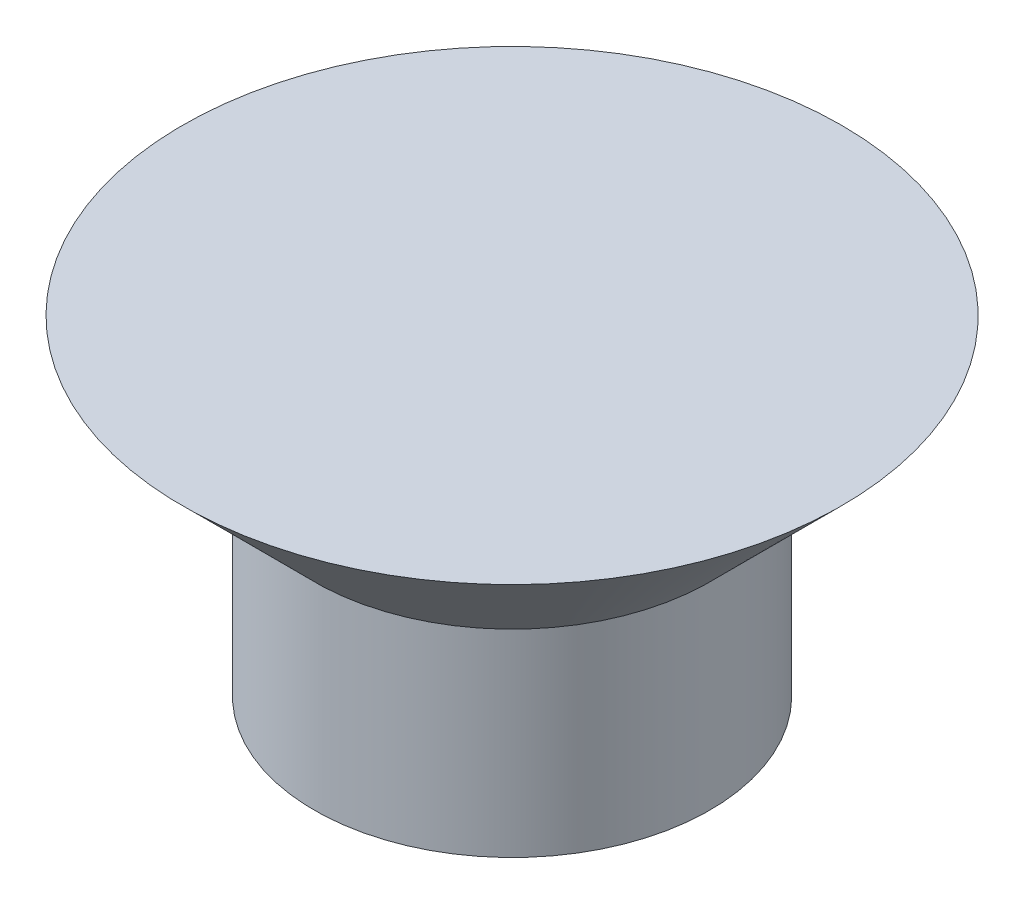
ISO-10303-21;
HEADER;
FILE_DESCRIPTION(('STEP AP214'),'2;1');
FILE_NAME('part.step','',(''),(''),'','','');
FILE_SCHEMA(('AUTOMOTIVE_DESIGN { 1 0 10303 214 1 1 1 1 }'));
ENDSEC;
DATA;
#1=APPLICATION_CONTEXT('core data for automotive mechanical design processes');
#2=APPLICATION_PROTOCOL_DEFINITION('international standard','automotive_design',2000,#1);
#3=PRODUCT_CONTEXT('',#1,'mechanical');
#4=PRODUCT('Part','Part','',(#3));
#5=PRODUCT_RELATED_PRODUCT_CATEGORY('part','',(#4));
#6=PRODUCT_DEFINITION_FORMATION('','',#4);
#7=PRODUCT_DEFINITION_CONTEXT('part definition',#1,'design');
#8=PRODUCT_DEFINITION('design','',#6,#7);
#9=PRODUCT_DEFINITION_SHAPE('','',#8);
#10=(LENGTH_UNIT() NAMED_UNIT(*) SI_UNIT(.MILLI.,.METRE.));
#11=(NAMED_UNIT(*) PLANE_ANGLE_UNIT() SI_UNIT($,.RADIAN.));
#12=(NAMED_UNIT(*) SI_UNIT($,.STERADIAN.) SOLID_ANGLE_UNIT());
#13=UNCERTAINTY_MEASURE_WITH_UNIT(LENGTH_MEASURE(1.E-05),#10,'distance_accuracy_value','');
#14=(GEOMETRIC_REPRESENTATION_CONTEXT(3) GLOBAL_UNCERTAINTY_ASSIGNED_CONTEXT((#13)) GLOBAL_UNIT_ASSIGNED_CONTEXT((#10,
#11,#12)) REPRESENTATION_CONTEXT('',''));
#15=CARTESIAN_POINT('',(0.,0.,0.));
#16=DIRECTION('',(0.,0.,1.));
#17=DIRECTION('',(1.,0.,0.));
#18=AXIS2_PLACEMENT_3D('',#15,#16,#17);
#19=CARTESIAN_POINT('',(1.5,0.,0.));
#20=DIRECTION('',(0.,-1.,0.));
#21=DIRECTION('',(0.,0.,-1.));
#22=AXIS2_PLACEMENT_3D('',#19,#20,#21);
#23=PLANE('',#22);
#24=CARTESIAN_POINT('',(0.,0.,0.));
#25=DIRECTION('',(0.,-1.,0.));
#26=DIRECTION('',(0.,0.,-1.));
#27=AXIS2_PLACEMENT_3D('',#24,#25,#26);
#28=CIRCLE('',#27,1.5);
#29=CARTESIAN_POINT('',(0.,0.,-1.5));
#30=VERTEX_POINT('',#29);
#31=EDGE_CURVE('E49',#30,#30,#28,.T.);
#32=ORIENTED_EDGE('',*,*,#31,.T.);
#33=EDGE_LOOP('',(#32));
#34=FACE_BOUND('',#33,.T.);
#35=ADVANCED_FACE('F39',(#34),#23,.T.);
#36=CARTESIAN_POINT('',(0.,2.5,0.));
#37=DIRECTION('',(0.,1.,0.));
#38=DIRECTION('',(0.,0.,1.));
#39=AXIS2_PLACEMENT_3D('',#36,#37,#38);
#40=PLANE('',#39);
#41=CARTESIAN_POINT('',(0.,2.5,0.));
#42=DIRECTION('',(0.,-1.,0.));
#43=DIRECTION('',(0.,0.,-1.));
#44=AXIS2_PLACEMENT_3D('',#41,#42,#43);
#45=CIRCLE('',#44,2.5);
#46=CARTESIAN_POINT('',(0.,2.5,-2.5));
#47=VERTEX_POINT('',#46);
#48=EDGE_CURVE('E11',#47,#47,#45,.T.);
#49=ORIENTED_EDGE('',*,*,#48,.F.);
#50=EDGE_LOOP('',(#49));
#51=FACE_BOUND('',#50,.T.);
#52=ADVANCED_FACE('F64',(#51),#40,.T.);
#53=CARTESIAN_POINT('',(0.,1.5,0.));
#54=DIRECTION('',(0.,1.,0.));
#55=DIRECTION('',(0.,0.,1.));
#56=AXIS2_PLACEMENT_3D('',#53,#54,#55);
#57=CONICAL_SURFACE('',#56,1.5,0.785398163397448);
#58=ORIENTED_EDGE('',*,*,#48,.T.);
#59=EDGE_LOOP('',(#58));
#60=FACE_BOUND('',#59,.T.);
#61=CARTESIAN_POINT('',(0.,1.5,0.));
#62=DIRECTION('',(0.,-1.,0.));
#63=DIRECTION('',(0.,0.,-1.));
#64=AXIS2_PLACEMENT_3D('',#61,#62,#63);
#65=CIRCLE('',#64,1.5);
#66=CARTESIAN_POINT('',(0.,1.5,-1.5));
#67=VERTEX_POINT('',#66);
#68=EDGE_CURVE('E45',#67,#67,#65,.T.);
#69=ORIENTED_EDGE('',*,*,#68,.F.);
#70=EDGE_LOOP('',(#69));
#71=FACE_BOUND('',#70,.T.);
#72=ADVANCED_FACE('F59',(#60,#71),#57,.T.);
#73=CARTESIAN_POINT('',(0.,0.,0.));
#74=DIRECTION('',(0.,-1.,0.));
#75=DIRECTION('',(0.,0.,-1.));
#76=AXIS2_PLACEMENT_3D('',#73,#74,#75);
#77=CYLINDRICAL_SURFACE('',#76,1.5);
#78=ORIENTED_EDGE('',*,*,#68,.T.);
#79=EDGE_LOOP('',(#78));
#80=FACE_BOUND('',#79,.T.);
#81=ORIENTED_EDGE('',*,*,#31,.F.);
#82=EDGE_LOOP('',(#81));
#83=FACE_BOUND('',#82,.T.);
#84=ADVANCED_FACE('F57',(#80,#83),#77,.T.);
#85=CLOSED_SHELL('',(#35,#52,#72,#84));
#86=MANIFOLD_SOLID_BREP('B2',#85);
#87=ADVANCED_BREP_SHAPE_REPRESENTATION('',(#18,#86),#14);
#88=SHAPE_DEFINITION_REPRESENTATION(#9,#87);
ENDSEC;
END-ISO-10303-21;
